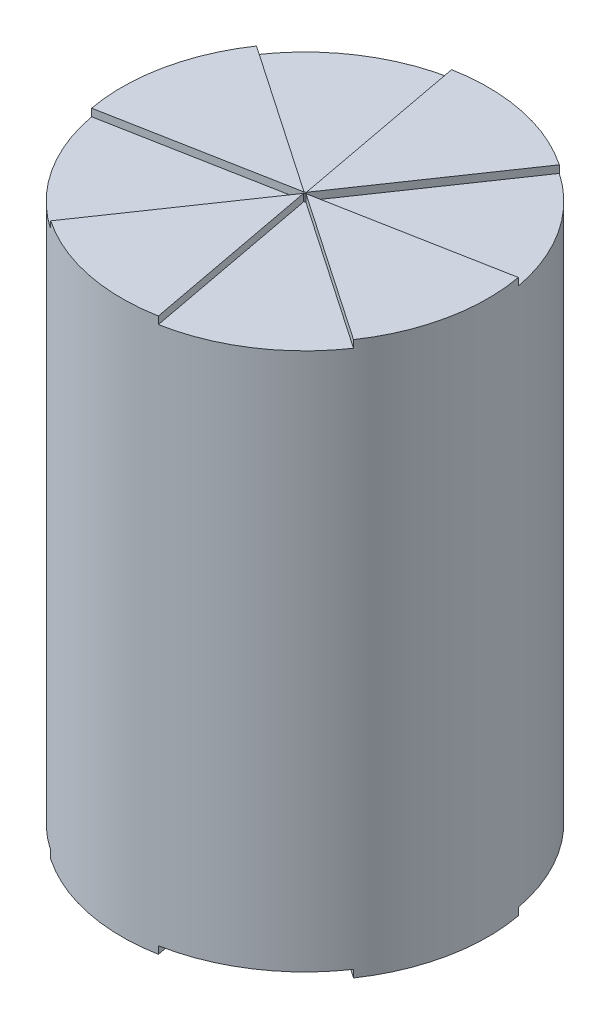
ISO-10303-21;
HEADER;
FILE_DESCRIPTION(('STEP AP214'),'2;1');
FILE_NAME('part.step','',(''),(''),'','','');
FILE_SCHEMA(('AUTOMOTIVE_DESIGN { 1 0 10303 214 1 1 1 1 }'));
ENDSEC;
DATA;
#1=APPLICATION_CONTEXT('core data for automotive mechanical design processes');
#2=APPLICATION_PROTOCOL_DEFINITION('international standard','automotive_design',2000,#1);
#3=PRODUCT_CONTEXT('',#1,'mechanical');
#4=PRODUCT('Part','Part','',(#3));
#5=PRODUCT_RELATED_PRODUCT_CATEGORY('part','',(#4));
#6=PRODUCT_DEFINITION_FORMATION('','',#4);
#7=PRODUCT_DEFINITION_CONTEXT('part definition',#1,'design');
#8=PRODUCT_DEFINITION('design','',#6,#7);
#9=PRODUCT_DEFINITION_SHAPE('','',#8);
#10=(LENGTH_UNIT() NAMED_UNIT(*) SI_UNIT(.MILLI.,.METRE.));
#11=(NAMED_UNIT(*) PLANE_ANGLE_UNIT() SI_UNIT($,.RADIAN.));
#12=(NAMED_UNIT(*) SI_UNIT($,.STERADIAN.) SOLID_ANGLE_UNIT());
#13=UNCERTAINTY_MEASURE_WITH_UNIT(LENGTH_MEASURE(1.E-05),#10,'distance_accuracy_value','');
#14=(GEOMETRIC_REPRESENTATION_CONTEXT(3) GLOBAL_UNCERTAINTY_ASSIGNED_CONTEXT((#13)) GLOBAL_UNIT_ASSIGNED_CONTEXT((#10,
#11,#12)) REPRESENTATION_CONTEXT('',''));
#15=CARTESIAN_POINT('',(0.,0.,0.));
#16=DIRECTION('',(0.,0.,1.));
#17=DIRECTION('',(1.,0.,0.));
#18=AXIS2_PLACEMENT_3D('',#15,#16,#17);
#19=CARTESIAN_POINT('',(0.,187.96,0.));
#20=DIRECTION('',(0.,-1.,0.));
#21=DIRECTION('',(0.,0.,-1.));
#22=AXIS2_PLACEMENT_3D('',#19,#20,#21);
#23=CYLINDRICAL_SURFACE('',#22,62.23);
#24=CARTESIAN_POINT('',(0.,185.42,0.));
#25=DIRECTION('',(0.,1.,0.));
#26=DIRECTION('',(-1.,0.,0.));
#27=AXIS2_PLACEMENT_3D('',#24,#25,#26);
#28=CIRCLE('',#27,62.23);
#29=CARTESIAN_POINT('',(11.3457915218461,185.42,61.1869750416116));
#30=VERTEX_POINT('',#29);
#31=CARTESIAN_POINT('',(51.4696538395341,185.42,34.9778163074617));
#32=VERTEX_POINT('',#31);
#33=EDGE_CURVE('E330',#30,#32,#28,.T.);
#34=ORIENTED_EDGE('',*,*,#33,.F.);
#35=DIRECTION('',(0.,1.,0.));
#36=VECTOR('',#35,1.);
#37=CARTESIAN_POINT('',(11.3457915218461,185.42,61.1869750416116));
#38=LINE('',#37,#36);
#39=CARTESIAN_POINT('',(11.3457915218461,187.96,61.1869750416116));
#40=VERTEX_POINT('',#39);
#41=EDGE_CURVE('E343',#30,#40,#38,.T.);
#42=ORIENTED_EDGE('',*,*,#41,.T.);
#43=CARTESIAN_POINT('',(0.,187.96,0.));
#44=DIRECTION('',(0.,1.,0.));
#45=DIRECTION('',(0.,0.,1.));
#46=AXIS2_PLACEMENT_3D('',#43,#44,#45);
#47=CIRCLE('',#46,62.23);
#48=CARTESIAN_POINT('',(-34.9778163074619,187.96,51.4696538395339));
#49=VERTEX_POINT('',#48);
#50=EDGE_CURVE('E11',#49,#40,#47,.T.);
#51=ORIENTED_EDGE('',*,*,#50,.F.);
#52=DIRECTION('',(0.,1.,0.));
#53=VECTOR('',#52,1.);
#54=CARTESIAN_POINT('',(-34.9778163074619,185.42,51.4696538395339));
#55=LINE('',#54,#53);
#56=CARTESIAN_POINT('',(-34.9778163074619,185.42,51.4696538395339));
#57=VERTEX_POINT('',#56);
#58=EDGE_CURVE('E56',#57,#49,#55,.T.);
#59=ORIENTED_EDGE('',*,*,#58,.F.);
#60=CARTESIAN_POINT('',(0.,185.42,0.));
#61=DIRECTION('',(0.,1.,0.));
#62=DIRECTION('',(0.,0.,-1.));
#63=AXIS2_PLACEMENT_3D('',#60,#61,#62);
#64=CIRCLE('',#63,62.23);
#65=CARTESIAN_POINT('',(-61.1869750416117,185.42,11.3457915218458));
#66=VERTEX_POINT('',#65);
#67=EDGE_CURVE('E354',#66,#57,#64,.T.);
#68=ORIENTED_EDGE('',*,*,#67,.F.);
#69=DIRECTION('',(0.,1.,0.));
#70=VECTOR('',#69,1.);
#71=CARTESIAN_POINT('',(-61.1869750416117,185.42,11.3457915218458));
#72=LINE('',#71,#70);
#73=CARTESIAN_POINT('',(-61.1869750416117,187.96,11.3457915218458));
#74=VERTEX_POINT('',#73);
#75=EDGE_CURVE('E372',#66,#74,#72,.T.);
#76=ORIENTED_EDGE('',*,*,#75,.T.);
#77=CARTESIAN_POINT('',(-51.4696538395343,187.96,-34.9778163074614));
#78=VERTEX_POINT('',#77);
#79=EDGE_CURVE('E41',#78,#74,#47,.T.);
#80=ORIENTED_EDGE('',*,*,#79,.F.);
#81=DIRECTION('',(0.,1.,0.));
#82=VECTOR('',#81,1.);
#83=CARTESIAN_POINT('',(-51.4696538395343,185.42,-34.9778163074614));
#84=LINE('',#83,#82);
#85=CARTESIAN_POINT('',(-51.4696538395343,185.42,-34.9778163074614));
#86=VERTEX_POINT('',#85);
#87=EDGE_CURVE('E300',#86,#78,#84,.T.);
#88=ORIENTED_EDGE('',*,*,#87,.F.);
#89=CARTESIAN_POINT('',(0.,185.42,0.));
#90=DIRECTION('',(0.,1.,0.));
#91=DIRECTION('',(1.,0.,0.));
#92=AXIS2_PLACEMENT_3D('',#89,#90,#91);
#93=CIRCLE('',#92,62.23);
#94=CARTESIAN_POINT('',(-11.3457915218465,185.42,-61.1869750416116));
#95=VERTEX_POINT('',#94);
#96=EDGE_CURVE('E291',#95,#86,#93,.T.);
#97=ORIENTED_EDGE('',*,*,#96,.F.);
#98=DIRECTION('',(0.,1.,0.));
#99=VECTOR('',#98,1.);
#100=CARTESIAN_POINT('',(-11.3457915218465,185.42,-61.1869750416116));
#101=LINE('',#100,#99);
#102=CARTESIAN_POINT('',(-11.3457915218465,187.96,-61.1869750416116));
#103=VERTEX_POINT('',#102);
#104=EDGE_CURVE('E303',#95,#103,#101,.T.);
#105=ORIENTED_EDGE('',*,*,#104,.T.);
#106=CARTESIAN_POINT('',(34.9778163074619,187.96,-51.4696538395339));
#107=VERTEX_POINT('',#106);
#108=EDGE_CURVE('E388',#107,#103,#47,.T.);
#109=ORIENTED_EDGE('',*,*,#108,.F.);
#110=DIRECTION('',(0.,1.,0.));
#111=VECTOR('',#110,1.);
#112=CARTESIAN_POINT('',(34.9778163074619,185.42,-51.4696538395339));
#113=LINE('',#112,#111);
#114=CARTESIAN_POINT('',(34.9778163074619,185.42,-51.4696538395339));
#115=VERTEX_POINT('',#114);
#116=EDGE_CURVE('E319',#115,#107,#113,.T.);
#117=ORIENTED_EDGE('',*,*,#116,.F.);
#118=CARTESIAN_POINT('',(0.,185.42,0.));
#119=DIRECTION('',(0.,1.,0.));
#120=DIRECTION('',(0.,0.,1.));
#121=AXIS2_PLACEMENT_3D('',#118,#119,#120);
#122=CIRCLE('',#121,62.23);
#123=CARTESIAN_POINT('',(61.1869750416117,185.42,-11.3457915218458));
#124=VERTEX_POINT('',#123);
#125=EDGE_CURVE('E310',#124,#115,#122,.T.);
#126=ORIENTED_EDGE('',*,*,#125,.F.);
#127=DIRECTION('',(0.,1.,0.));
#128=VECTOR('',#127,1.);
#129=CARTESIAN_POINT('',(61.1869750416117,185.42,-11.3457915218458));
#130=LINE('',#129,#128);
#131=CARTESIAN_POINT('',(61.1869750416117,187.96,-11.3457915218458));
#132=VERTEX_POINT('',#131);
#133=EDGE_CURVE('E323',#124,#132,#130,.T.);
#134=ORIENTED_EDGE('',*,*,#133,.T.);
#135=CARTESIAN_POINT('',(51.4696538395341,187.96,34.9778163074617));
#136=VERTEX_POINT('',#135);
#137=EDGE_CURVE('E40',#136,#132,#47,.T.);
#138=ORIENTED_EDGE('',*,*,#137,.F.);
#139=DIRECTION('',(0.,1.,0.));
#140=VECTOR('',#139,1.);
#141=CARTESIAN_POINT('',(51.4696538395341,185.42,34.9778163074617));
#142=LINE('',#141,#140);
#143=EDGE_CURVE('E339',#32,#136,#142,.T.);
#144=ORIENTED_EDGE('',*,*,#143,.F.);
#145=EDGE_LOOP('',(#34,#42,#51,#59,#68,#76,#80,#88,#97,#105,#109,#117,#126,#134,#138,#144));
#146=FACE_BOUND('',#145,.T.);
#147=DIRECTION('',(0.,-1.,0.));
#148=VECTOR('',#147,1.);
#149=CARTESIAN_POINT('',(-34.9778163074619,2.54,51.4696538395339));
#150=LINE('',#149,#148);
#151=CARTESIAN_POINT('',(-34.9778163074619,2.54,51.4696538395339));
#152=VERTEX_POINT('',#151);
#153=CARTESIAN_POINT('',(-34.9778163074619,0.,51.4696538395339));
#154=VERTEX_POINT('',#153);
#155=EDGE_CURVE('E287',#152,#154,#150,.T.);
#156=ORIENTED_EDGE('',*,*,#155,.T.);
#157=CARTESIAN_POINT('',(0.,0.,0.));
#158=DIRECTION('',(0.,1.,0.));
#159=DIRECTION('',(0.,0.,1.));
#160=AXIS2_PLACEMENT_3D('',#157,#158,#159);
#161=CIRCLE('',#160,62.23);
#162=CARTESIAN_POINT('',(11.3457915218461,0.,61.1869750416116));
#163=VERTEX_POINT('',#162);
#164=EDGE_CURVE('E35',#154,#163,#161,.T.);
#165=ORIENTED_EDGE('',*,*,#164,.T.);
#166=DIRECTION('',(0.,-1.,0.));
#167=VECTOR('',#166,1.);
#168=CARTESIAN_POINT('',(11.3457915218461,2.54,61.1869750416116));
#169=LINE('',#168,#167);
#170=CARTESIAN_POINT('',(11.3457915218461,2.54,61.1869750416116));
#171=VERTEX_POINT('',#170);
#172=EDGE_CURVE('E251',#171,#163,#169,.T.);
#173=ORIENTED_EDGE('',*,*,#172,.F.);
#174=CARTESIAN_POINT('',(0.,2.54,0.));
#175=DIRECTION('',(0.,1.,0.));
#176=DIRECTION('',(-1.,0.,0.));
#177=AXIS2_PLACEMENT_3D('',#174,#175,#176);
#178=CIRCLE('',#177,62.23);
#179=CARTESIAN_POINT('',(51.4696538395341,2.54,34.9778163074617));
#180=VERTEX_POINT('',#179);
#181=EDGE_CURVE('E242',#171,#180,#178,.T.);
#182=ORIENTED_EDGE('',*,*,#181,.T.);
#183=DIRECTION('',(0.,-1.,0.));
#184=VECTOR('',#183,1.);
#185=CARTESIAN_POINT('',(51.4696538395341,2.54,34.9778163074617));
#186=LINE('',#185,#184);
#187=CARTESIAN_POINT('',(51.4696538395341,0.,34.9778163074617));
#188=VERTEX_POINT('',#187);
#189=EDGE_CURVE('E256',#180,#188,#186,.T.);
#190=ORIENTED_EDGE('',*,*,#189,.T.);
#191=CARTESIAN_POINT('',(61.1869750416117,0.,-11.3457915218458));
#192=VERTEX_POINT('',#191);
#193=EDGE_CURVE('E381',#188,#192,#161,.T.);
#194=ORIENTED_EDGE('',*,*,#193,.T.);
#195=DIRECTION('',(0.,-1.,0.));
#196=VECTOR('',#195,1.);
#197=CARTESIAN_POINT('',(61.1869750416117,2.54,-11.3457915218458));
#198=LINE('',#197,#196);
#199=CARTESIAN_POINT('',(61.1869750416117,2.54,-11.3457915218458));
#200=VERTEX_POINT('',#199);
#201=EDGE_CURVE('E231',#200,#192,#198,.T.);
#202=ORIENTED_EDGE('',*,*,#201,.F.);
#203=CARTESIAN_POINT('',(0.,2.54,0.));
#204=DIRECTION('',(0.,1.,0.));
#205=DIRECTION('',(0.,0.,1.));
#206=AXIS2_PLACEMENT_3D('',#203,#204,#205);
#207=CIRCLE('',#206,62.23);
#208=CARTESIAN_POINT('',(34.9778163074619,2.54,-51.4696538395339));
#209=VERTEX_POINT('',#208);
#210=EDGE_CURVE('E223',#200,#209,#207,.T.);
#211=ORIENTED_EDGE('',*,*,#210,.T.);
#212=DIRECTION('',(0.,-1.,0.));
#213=VECTOR('',#212,1.);
#214=CARTESIAN_POINT('',(34.9778163074619,2.54,-51.4696538395339));
#215=LINE('',#214,#213);
#216=CARTESIAN_POINT('',(34.9778163074619,0.,-51.4696538395339));
#217=VERTEX_POINT('',#216);
#218=EDGE_CURVE('E236',#209,#217,#215,.T.);
#219=ORIENTED_EDGE('',*,*,#218,.T.);
#220=CARTESIAN_POINT('',(-11.3457915218465,0.,-61.1869750416116));
#221=VERTEX_POINT('',#220);
#222=EDGE_CURVE('E215',#217,#221,#161,.T.);
#223=ORIENTED_EDGE('',*,*,#222,.T.);
#224=DIRECTION('',(0.,-1.,0.));
#225=VECTOR('',#224,1.);
#226=CARTESIAN_POINT('',(-11.3457915218465,2.54,-61.1869750416116));
#227=LINE('',#226,#225);
#228=CARTESIAN_POINT('',(-11.3457915218465,2.54,-61.1869750416116));
#229=VERTEX_POINT('',#228);
#230=EDGE_CURVE('E48',#229,#221,#227,.T.);
#231=ORIENTED_EDGE('',*,*,#230,.F.);
#232=CARTESIAN_POINT('',(0.,2.54,0.));
#233=DIRECTION('',(0.,1.,0.));
#234=DIRECTION('',(1.,0.,0.));
#235=AXIS2_PLACEMENT_3D('',#232,#233,#234);
#236=CIRCLE('',#235,62.23);
#237=CARTESIAN_POINT('',(-51.4696538395343,2.54,-34.9778163074614));
#238=VERTEX_POINT('',#237);
#239=EDGE_CURVE('E201',#229,#238,#236,.T.);
#240=ORIENTED_EDGE('',*,*,#239,.T.);
#241=DIRECTION('',(0.,-1.,0.));
#242=VECTOR('',#241,1.);
#243=CARTESIAN_POINT('',(-51.4696538395343,2.54,-34.9778163074614));
#244=LINE('',#243,#242);
#245=CARTESIAN_POINT('',(-51.4696538395343,0.,-34.9778163074614));
#246=VERTEX_POINT('',#245);
#247=EDGE_CURVE('E216',#238,#246,#244,.T.);
#248=ORIENTED_EDGE('',*,*,#247,.T.);
#249=CARTESIAN_POINT('',(-61.1869750416117,0.,11.3457915218458));
#250=VERTEX_POINT('',#249);
#251=EDGE_CURVE('E380',#246,#250,#161,.T.);
#252=ORIENTED_EDGE('',*,*,#251,.T.);
#253=DIRECTION('',(0.,-1.,0.));
#254=VECTOR('',#253,1.);
#255=CARTESIAN_POINT('',(-61.1869750416117,2.54,11.3457915218458));
#256=LINE('',#255,#254);
#257=CARTESIAN_POINT('',(-61.1869750416117,2.54,11.3457915218458));
#258=VERTEX_POINT('',#257);
#259=EDGE_CURVE('E279',#258,#250,#256,.T.);
#260=ORIENTED_EDGE('',*,*,#259,.F.);
#261=CARTESIAN_POINT('',(0.,2.54,0.));
#262=DIRECTION('',(0.,1.,0.));
#263=DIRECTION('',(0.,0.,-1.));
#264=AXIS2_PLACEMENT_3D('',#261,#262,#263);
#265=CIRCLE('',#264,62.23);
#266=EDGE_CURVE('E267',#258,#152,#265,.T.);
#267=ORIENTED_EDGE('',*,*,#266,.T.);
#268=EDGE_LOOP('',(#156,#165,#173,#182,#190,#194,#202,#211,#219,#223,#231,#240,#248,#252,#260,#267));
#269=FACE_BOUND('',#268,.T.);
#270=ADVANCED_FACE('F32',(#146,#269),#23,.T.);
#271=CARTESIAN_POINT('',(0.,0.,0.));
#272=DIRECTION('',(0.,1.,0.));
#273=DIRECTION('',(0.,0.,1.));
#274=AXIS2_PLACEMENT_3D('',#271,#272,#273);
#275=PLANE('',#274);
#276=DIRECTION('',(0.56420608270553,0.,-0.825633996537255));
#277=VECTOR('',#276,1.);
#278=CARTESIAN_POINT('',(-34.9778163074619,0.,51.4696538395339));
#279=LINE('',#278,#277);
#280=CARTESIAN_POINT('',(-0.0861680748122756,0.,0.410773300789611));
#281=VERTEX_POINT('',#280);
#282=EDGE_CURVE('E271',#154,#281,#279,.T.);
#283=ORIENTED_EDGE('',*,*,#282,.T.);
#284=DIRECTION('',(0.184857450661874,0.,0.982765344797421));
#285=VECTOR('',#284,1.);
#286=CARTESIAN_POINT('',(-0.121475110096735,0.,0.223069042287327));
#287=LINE('',#286,#285);
#288=EDGE_CURVE('E241',#281,#163,#287,.T.);
#289=ORIENTED_EDGE('',*,*,#288,.T.);
#290=ORIENTED_EDGE('',*,*,#164,.F.);
#291=EDGE_LOOP('',(#283,#289,#290));
#292=FACE_BOUND('',#291,.T.);
#293=ADVANCED_FACE('F447',(#292),#275,.F.);
#294=DIRECTION('',(-0.982765344797421,0.,0.18485745066187));
#295=VECTOR('',#294,1.);
#296=CARTESIAN_POINT('',(-0.223069042287327,0.,-0.121475110096735));
#297=LINE('',#296,#295);
#298=CARTESIAN_POINT('',(-0.410773300789609,0.,-0.086168074812274));
#299=VERTEX_POINT('',#298);
#300=EDGE_CURVE('E266',#299,#250,#297,.T.);
#301=ORIENTED_EDGE('',*,*,#300,.T.);
#302=ORIENTED_EDGE('',*,*,#251,.F.);
#303=DIRECTION('',(0.825633996537261,0.,0.564206082705522));
#304=VECTOR('',#303,1.);
#305=CARTESIAN_POINT('',(-51.4696538395343,0.,-34.9778163074614));
#306=LINE('',#305,#304);
#307=EDGE_CURVE('E209',#246,#299,#306,.T.);
#308=ORIENTED_EDGE('',*,*,#307,.T.);
#309=EDGE_LOOP('',(#301,#302,#308));
#310=FACE_BOUND('',#309,.T.);
#311=ADVANCED_FACE('F451',(#310),#275,.F.);
#312=DIRECTION('',(-0.825633996537257,0.,-0.564206082705527));
#313=VECTOR('',#312,1.);
#314=CARTESIAN_POINT('',(51.4696538395341,0.,34.9778163074617));
#315=LINE('',#314,#313);
#316=CARTESIAN_POINT('',(0.410773300789592,0.,0.086168074812271));
#317=VERTEX_POINT('',#316);
#318=EDGE_CURVE('E246',#188,#317,#315,.T.);
#319=ORIENTED_EDGE('',*,*,#318,.T.);
#320=DIRECTION('',(0.982765344797421,0.,-0.18485745066187));
#321=VECTOR('',#320,1.);
#322=CARTESIAN_POINT('',(0.223069042287327,0.,0.121475110096735));
#323=LINE('',#322,#321);
#324=EDGE_CURVE('E218',#317,#192,#323,.T.);
#325=ORIENTED_EDGE('',*,*,#324,.T.);
#326=ORIENTED_EDGE('',*,*,#193,.F.);
#327=EDGE_LOOP('',(#319,#325,#326));
#328=FACE_BOUND('',#327,.T.);
#329=ADVANCED_FACE('F457',(#328),#275,.F.);
#330=DIRECTION('',(-0.56420608270553,0.,0.825633996537255));
#331=VECTOR('',#330,1.);
#332=CARTESIAN_POINT('',(34.9778163074619,0.,-51.4696538395339));
#333=LINE('',#332,#331);
#334=CARTESIAN_POINT('',(0.086168074812272,0.,-0.410773300789591));
#335=VERTEX_POINT('',#334);
#336=EDGE_CURVE('E227',#217,#335,#333,.T.);
#337=ORIENTED_EDGE('',*,*,#336,.T.);
#338=DIRECTION('',(-0.184857450661881,0.,-0.982765344797419));
#339=VECTOR('',#338,1.);
#340=CARTESIAN_POINT('',(0.121475110096733,0.,-0.223069042287328));
#341=LINE('',#340,#339);
#342=EDGE_CURVE('E474',#335,#221,#341,.T.);
#343=ORIENTED_EDGE('',*,*,#342,.T.);
#344=ORIENTED_EDGE('',*,*,#222,.F.);
#345=EDGE_LOOP('',(#337,#343,#344));
#346=FACE_BOUND('',#345,.T.);
#347=ADVANCED_FACE('F461',(#346),#275,.F.);
#348=CARTESIAN_POINT('',(0.,187.96,0.));
#349=DIRECTION('',(0.,1.,0.));
#350=DIRECTION('',(0.,0.,1.));
#351=AXIS2_PLACEMENT_3D('',#348,#349,#350);
#352=PLANE('',#351);
#353=DIRECTION('',(0.184857450661874,0.,0.982765344797421));
#354=VECTOR('',#353,1.);
#355=CARTESIAN_POINT('',(-0.121475110096735,187.96,0.223069042287327));
#356=LINE('',#355,#354);
#357=CARTESIAN_POINT('',(-0.0861680748122707,187.96,0.410773300789586));
#358=VERTEX_POINT('',#357);
#359=EDGE_CURVE('E334',#358,#40,#356,.T.);
#360=ORIENTED_EDGE('',*,*,#359,.F.);
#361=DIRECTION('',(0.56420608270553,0.,-0.825633996537255));
#362=VECTOR('',#361,1.);
#363=CARTESIAN_POINT('',(-34.9778163074619,187.96,51.4696538395339));
#364=LINE('',#363,#362);
#365=EDGE_CURVE('E353',#49,#358,#364,.T.);
#366=ORIENTED_EDGE('',*,*,#365,.F.);
#367=ORIENTED_EDGE('',*,*,#50,.T.);
#368=EDGE_LOOP('',(#360,#366,#367));
#369=FACE_BOUND('',#368,.T.);
#370=ADVANCED_FACE('F421',(#369),#352,.T.);
#371=CARTESIAN_POINT('',(0.,187.96,0.));
#372=DIRECTION('',(0.,-1.,0.));
#373=DIRECTION('',(0.,0.,-1.));
#374=AXIS2_PLACEMENT_3D('',#371,#372,#373);
#375=CIRCLE('',#374,0.253999999999998);
#376=CARTESIAN_POINT('',(0.,187.96,-0.253999999999998));
#377=VERTEX_POINT('',#376);
#378=EDGE_CURVE('E367',#377,#377,#375,.T.);
#379=ORIENTED_EDGE('',*,*,#378,.F.);
#380=EDGE_LOOP('',(#379));
#381=FACE_BOUND('',#380,.T.);
#382=ADVANCED_FACE('F444',(#381),#352,.T.);
#383=DIRECTION('',(-0.825633996537257,0.,-0.564206082705527));
#384=VECTOR('',#383,1.);
#385=CARTESIAN_POINT('',(51.4696538395341,187.96,34.9778163074617));
#386=LINE('',#385,#384);
#387=CARTESIAN_POINT('',(0.410773300789593,187.96,0.0861680748122769));
#388=VERTEX_POINT('',#387);
#389=EDGE_CURVE('E329',#136,#388,#386,.T.);
#390=ORIENTED_EDGE('',*,*,#389,.F.);
#391=ORIENTED_EDGE('',*,*,#137,.T.);
#392=DIRECTION('',(0.982765344797421,0.,-0.18485745066187));
#393=VECTOR('',#392,1.);
#394=CARTESIAN_POINT('',(0.223069042287327,187.96,0.121475110096735));
#395=LINE('',#394,#393);
#396=EDGE_CURVE('E314',#388,#132,#395,.T.);
#397=ORIENTED_EDGE('',*,*,#396,.F.);
#398=EDGE_LOOP('',(#390,#391,#397));
#399=FACE_BOUND('',#398,.T.);
#400=ADVANCED_FACE('F402',(#399),#352,.T.);
#401=DIRECTION('',(-0.56420608270553,0.,0.825633996537255));
#402=VECTOR('',#401,1.);
#403=CARTESIAN_POINT('',(34.9778163074619,187.96,-51.4696538395339));
#404=LINE('',#403,#402);
#405=CARTESIAN_POINT('',(0.0861680748122732,187.96,-0.410773300789591));
#406=VERTEX_POINT('',#405);
#407=EDGE_CURVE('E309',#107,#406,#404,.T.);
#408=ORIENTED_EDGE('',*,*,#407,.F.);
#409=ORIENTED_EDGE('',*,*,#108,.T.);
#410=DIRECTION('',(-0.184857450661881,0.,-0.982765344797419));
#411=VECTOR('',#410,1.);
#412=CARTESIAN_POINT('',(0.121475110096733,187.96,-0.223069042287328));
#413=LINE('',#412,#411);
#414=EDGE_CURVE('E295',#406,#103,#413,.T.);
#415=ORIENTED_EDGE('',*,*,#414,.F.);
#416=EDGE_LOOP('',(#408,#409,#415));
#417=FACE_BOUND('',#416,.T.);
#418=ADVANCED_FACE('F437',(#417),#352,.T.);
#419=DIRECTION('',(0.825633996537261,0.,0.564206082705522));
#420=VECTOR('',#419,1.);
#421=CARTESIAN_POINT('',(-51.4696538395343,187.96,-34.9778163074614));
#422=LINE('',#421,#420);
#423=CARTESIAN_POINT('',(-0.410773300789619,187.96,-0.0861680748122789));
#424=VERTEX_POINT('',#423);
#425=EDGE_CURVE('E289',#78,#424,#422,.T.);
#426=ORIENTED_EDGE('',*,*,#425,.F.);
#427=ORIENTED_EDGE('',*,*,#79,.T.);
#428=DIRECTION('',(-0.982765344797421,0.,0.18485745066187));
#429=VECTOR('',#428,1.);
#430=CARTESIAN_POINT('',(-0.223069042287327,187.96,-0.121475110096735));
#431=LINE('',#430,#429);
#432=EDGE_CURVE('E358',#424,#74,#431,.T.);
#433=ORIENTED_EDGE('',*,*,#432,.F.);
#434=EDGE_LOOP('',(#426,#427,#433));
#435=FACE_BOUND('',#434,.T.);
#436=ADVANCED_FACE('F426',(#435),#352,.T.);
#437=CARTESIAN_POINT('',(-0.223069042287327,185.42,-0.121475110096735));
#438=DIRECTION('',(-0.18485745066187,0.,-0.982765344797421));
#439=DIRECTION('',(-0.982765344797421,0.,0.18485745066187));
#440=AXIS2_PLACEMENT_3D('',#437,#438,#439);
#441=PLANE('',#440);
#442=DIRECTION('',(-0.982765344797421,0.,0.18485745066187));
#443=VECTOR('',#442,1.);
#444=CARTESIAN_POINT('',(-0.223069042287327,185.42,-0.121475110096735));
#445=LINE('',#444,#443);
#446=CARTESIAN_POINT('',(-0.410773300789619,185.42,-0.0861680748122789));
#447=VERTEX_POINT('',#446);
#448=EDGE_CURVE('E364',#447,#66,#445,.T.);
#449=ORIENTED_EDGE('',*,*,#448,.F.);
#450=DIRECTION('',(0.,1.,0.));
#451=VECTOR('',#450,1.);
#452=CARTESIAN_POINT('',(-0.41077330078961,185.42,-0.0861680748122737));
#453=LINE('',#452,#451);
#454=EDGE_CURVE('E346',#447,#424,#453,.T.);
#455=ORIENTED_EDGE('',*,*,#454,.T.);
#456=ORIENTED_EDGE('',*,*,#432,.T.);
#457=ORIENTED_EDGE('',*,*,#75,.F.);
#458=EDGE_LOOP('',(#449,#455,#456,#457));
#459=FACE_BOUND('',#458,.T.);
#460=ADVANCED_FACE('F425',(#459),#441,.F.);
#461=CARTESIAN_POINT('',(0.,185.42,0.));
#462=DIRECTION('',(0.,1.,0.));
#463=DIRECTION('',(0.,0.,1.));
#464=AXIS2_PLACEMENT_3D('',#461,#462,#463);
#465=CYLINDRICAL_SURFACE('',#464,0.253999999999998);
#466=ORIENTED_EDGE('',*,*,#378,.T.);
#467=EDGE_LOOP('',(#466));
#468=FACE_BOUND('',#467,.T.);
#469=CARTESIAN_POINT('',(0.,185.42,0.));
#470=DIRECTION('',(0.,-1.,0.));
#471=DIRECTION('',(0.,0.,-1.));
#472=AXIS2_PLACEMENT_3D('',#469,#470,#471);
#473=CIRCLE('',#472,0.253999999999998);
#474=CARTESIAN_POINT('',(0.,185.42,-0.253999999999998));
#475=VERTEX_POINT('',#474);
#476=EDGE_CURVE('E361',#475,#475,#473,.T.);
#477=ORIENTED_EDGE('',*,*,#476,.F.);
#478=EDGE_LOOP('',(#477));
#479=FACE_BOUND('',#478,.T.);
#480=ADVANCED_FACE('F544',(#468,#479),#465,.T.);
#481=CARTESIAN_POINT('',(-34.9778163074619,185.42,51.4696538395339));
#482=DIRECTION('',(0.825633996537255,0.,0.56420608270553));
#483=DIRECTION('',(0.56420608270553,0.,-0.825633996537255));
#484=AXIS2_PLACEMENT_3D('',#481,#482,#483);
#485=PLANE('',#484);
#486=ORIENTED_EDGE('',*,*,#365,.T.);
#487=DIRECTION('',(0.,-1.,0.));
#488=VECTOR('',#487,1.);
#489=CARTESIAN_POINT('',(-0.086168074812272,185.42,0.410773300789605));
#490=LINE('',#489,#488);
#491=CARTESIAN_POINT('',(-0.0861680748122723,185.42,0.41077330078961));
#492=VERTEX_POINT('',#491);
#493=EDGE_CURVE('E350',#358,#492,#490,.T.);
#494=ORIENTED_EDGE('',*,*,#493,.T.);
#495=DIRECTION('',(0.56420608270553,0.,-0.825633996537255));
#496=VECTOR('',#495,1.);
#497=CARTESIAN_POINT('',(-34.9778163074619,185.42,51.4696538395339));
#498=LINE('',#497,#496);
#499=EDGE_CURVE('E357',#57,#492,#498,.T.);
#500=ORIENTED_EDGE('',*,*,#499,.F.);
#501=ORIENTED_EDGE('',*,*,#58,.T.);
#502=EDGE_LOOP('',(#486,#494,#500,#501));
#503=FACE_BOUND('',#502,.T.);
#504=ADVANCED_FACE('F422',(#503),#485,.F.);
#505=CARTESIAN_POINT('',(0.,185.42,0.));
#506=DIRECTION('',(0.,-1.,0.));
#507=DIRECTION('',(0.,0.,-1.));
#508=AXIS2_PLACEMENT_3D('',#505,#506,#507);
#509=PLANE('',#508);
#510=DIRECTION('',(0.825633996537261,0.,0.564206082705522));
#511=VECTOR('',#510,1.);
#512=CARTESIAN_POINT('',(-51.4696538395343,185.42,-34.9778163074614));
#513=LINE('',#512,#511);
#514=EDGE_CURVE('E294',#86,#447,#513,.T.);
#515=ORIENTED_EDGE('',*,*,#514,.T.);
#516=ORIENTED_EDGE('',*,*,#448,.T.);
#517=ORIENTED_EDGE('',*,*,#67,.T.);
#518=ORIENTED_EDGE('',*,*,#499,.T.);
#519=DIRECTION('',(0.184857450661874,0.,0.982765344797421));
#520=VECTOR('',#519,1.);
#521=CARTESIAN_POINT('',(-0.121475110096735,185.42,0.223069042287327));
#522=LINE('',#521,#520);
#523=EDGE_CURVE('E337',#492,#30,#522,.T.);
#524=ORIENTED_EDGE('',*,*,#523,.T.);
#525=ORIENTED_EDGE('',*,*,#33,.T.);
#526=DIRECTION('',(-0.825633996537257,0.,-0.564206082705527));
#527=VECTOR('',#526,1.);
#528=CARTESIAN_POINT('',(51.4696538395341,185.42,34.9778163074617));
#529=LINE('',#528,#527);
#530=CARTESIAN_POINT('',(0.410773300789593,185.42,0.0861680748122769));
#531=VERTEX_POINT('',#530);
#532=EDGE_CURVE('E333',#32,#531,#529,.T.);
#533=ORIENTED_EDGE('',*,*,#532,.T.);
#534=DIRECTION('',(0.982765344797421,0.,-0.18485745066187));
#535=VECTOR('',#534,1.);
#536=CARTESIAN_POINT('',(0.223069042287327,185.42,0.121475110096735));
#537=LINE('',#536,#535);
#538=EDGE_CURVE('E317',#531,#124,#537,.T.);
#539=ORIENTED_EDGE('',*,*,#538,.T.);
#540=ORIENTED_EDGE('',*,*,#125,.T.);
#541=DIRECTION('',(-0.56420608270553,0.,0.825633996537255));
#542=VECTOR('',#541,1.);
#543=CARTESIAN_POINT('',(34.9778163074619,185.42,-51.4696538395339));
#544=LINE('',#543,#542);
#545=CARTESIAN_POINT('',(0.0861680748122732,185.42,-0.410773300789591));
#546=VERTEX_POINT('',#545);
#547=EDGE_CURVE('E313',#115,#546,#544,.T.);
#548=ORIENTED_EDGE('',*,*,#547,.T.);
#549=DIRECTION('',(-0.184857450661881,0.,-0.982765344797419));
#550=VECTOR('',#549,1.);
#551=CARTESIAN_POINT('',(0.121475110096733,185.42,-0.223069042287328));
#552=LINE('',#551,#550);
#553=EDGE_CURVE('E298',#546,#95,#552,.T.);
#554=ORIENTED_EDGE('',*,*,#553,.T.);
#555=ORIENTED_EDGE('',*,*,#96,.T.);
#556=EDGE_LOOP('',(#515,#516,#517,#518,#524,#525,#533,#539,#540,#548,#554,#555));
#557=FACE_BOUND('',#556,.T.);
#558=ORIENTED_EDGE('',*,*,#476,.T.);
#559=EDGE_LOOP('',(#558));
#560=FACE_BOUND('',#559,.T.);
#561=ADVANCED_FACE('F414',(#557,#560),#509,.F.);
#562=CARTESIAN_POINT('',(-0.121475110096735,185.42,0.223069042287327));
#563=DIRECTION('',(-0.98276534479742,0.,0.184857450661874));
#564=DIRECTION('',(0.184857450661874,0.,0.982765344797421));
#565=AXIS2_PLACEMENT_3D('',#562,#563,#564);
#566=PLANE('',#565);
#567=ORIENTED_EDGE('',*,*,#359,.T.);
#568=ORIENTED_EDGE('',*,*,#41,.F.);
#569=ORIENTED_EDGE('',*,*,#523,.F.);
#570=ORIENTED_EDGE('',*,*,#493,.F.);
#571=EDGE_LOOP('',(#567,#568,#569,#570));
#572=FACE_BOUND('',#571,.T.);
#573=ADVANCED_FACE('F531',(#572),#566,.F.);
#574=CARTESIAN_POINT('',(-51.4696538395343,185.42,-34.9778163074614));
#575=DIRECTION('',(-0.564206082705522,0.,0.825633996537261));
#576=DIRECTION('',(0.825633996537261,0.,0.564206082705522));
#577=AXIS2_PLACEMENT_3D('',#574,#575,#576);
#578=PLANE('',#577);
#579=ORIENTED_EDGE('',*,*,#514,.F.);
#580=ORIENTED_EDGE('',*,*,#87,.T.);
#581=ORIENTED_EDGE('',*,*,#425,.T.);
#582=ORIENTED_EDGE('',*,*,#454,.F.);
#583=EDGE_LOOP('',(#579,#580,#581,#582));
#584=FACE_BOUND('',#583,.T.);
#585=ADVANCED_FACE('F430',(#584),#578,.F.);
#586=CARTESIAN_POINT('',(51.4696538395341,185.42,34.9778163074617));
#587=DIRECTION('',(0.564206082705527,0.,-0.825633996537257));
#588=DIRECTION('',(-0.825633996537257,0.,-0.564206082705528));
#589=AXIS2_PLACEMENT_3D('',#586,#587,#588);
#590=PLANE('',#589);
#591=DIRECTION('',(0.,-1.,0.));
#592=VECTOR('',#591,1.);
#593=CARTESIAN_POINT('',(0.410773300789598,185.42,0.086168074812272));
#594=LINE('',#593,#592);
#595=EDGE_CURVE('E326',#388,#531,#594,.T.);
#596=ORIENTED_EDGE('',*,*,#595,.T.);
#597=ORIENTED_EDGE('',*,*,#532,.F.);
#598=ORIENTED_EDGE('',*,*,#143,.T.);
#599=ORIENTED_EDGE('',*,*,#389,.T.);
#600=EDGE_LOOP('',(#596,#597,#598,#599));
#601=FACE_BOUND('',#600,.T.);
#602=ADVANCED_FACE('F412',(#601),#590,.F.);
#603=CARTESIAN_POINT('',(0.223069042287327,185.42,0.121475110096735));
#604=DIRECTION('',(0.18485745066187,0.,0.982765344797421));
#605=DIRECTION('',(0.982765344797421,0.,-0.18485745066187));
#606=AXIS2_PLACEMENT_3D('',#603,#604,#605);
#607=PLANE('',#606);
#608=ORIENTED_EDGE('',*,*,#396,.T.);
#609=ORIENTED_EDGE('',*,*,#133,.F.);
#610=ORIENTED_EDGE('',*,*,#538,.F.);
#611=ORIENTED_EDGE('',*,*,#595,.F.);
#612=EDGE_LOOP('',(#608,#609,#610,#611));
#613=FACE_BOUND('',#612,.T.);
#614=ADVANCED_FACE('F410',(#613),#607,.F.);
#615=CARTESIAN_POINT('',(34.9778163074619,185.42,-51.4696538395339));
#616=DIRECTION('',(-0.825633996537255,0.,-0.56420608270553));
#617=DIRECTION('',(-0.56420608270553,0.,0.825633996537255));
#618=AXIS2_PLACEMENT_3D('',#615,#616,#617);
#619=PLANE('',#618);
#620=DIRECTION('',(0.,-1.,0.));
#621=VECTOR('',#620,1.);
#622=CARTESIAN_POINT('',(0.086168074812272,185.42,-0.410773300789598));
#623=LINE('',#622,#621);
#624=EDGE_CURVE('E306',#406,#546,#623,.T.);
#625=ORIENTED_EDGE('',*,*,#624,.T.);
#626=ORIENTED_EDGE('',*,*,#547,.F.);
#627=ORIENTED_EDGE('',*,*,#116,.T.);
#628=ORIENTED_EDGE('',*,*,#407,.T.);
#629=EDGE_LOOP('',(#625,#626,#627,#628));
#630=FACE_BOUND('',#629,.T.);
#631=ADVANCED_FACE('F436',(#630),#619,.F.);
#632=CARTESIAN_POINT('',(0.121475110096733,185.42,-0.223069042287328));
#633=DIRECTION('',(0.982765344797419,0.,-0.184857450661881));
#634=DIRECTION('',(-0.184857450661881,0.,-0.982765344797419));
#635=AXIS2_PLACEMENT_3D('',#632,#633,#634);
#636=PLANE('',#635);
#637=ORIENTED_EDGE('',*,*,#414,.T.);
#638=ORIENTED_EDGE('',*,*,#104,.F.);
#639=ORIENTED_EDGE('',*,*,#553,.F.);
#640=ORIENTED_EDGE('',*,*,#624,.F.);
#641=EDGE_LOOP('',(#637,#638,#639,#640));
#642=FACE_BOUND('',#641,.T.);
#643=ADVANCED_FACE('F434',(#642),#636,.F.);
#644=CARTESIAN_POINT('',(-34.9778163074619,2.54,51.4696538395339));
#645=DIRECTION('',(-0.825633996537255,0.,-0.56420608270553));
#646=DIRECTION('',(-0.56420608270553,0.,0.825633996537255));
#647=AXIS2_PLACEMENT_3D('',#644,#645,#646);
#648=PLANE('',#647);
#649=DIRECTION('',(0.,-1.,0.));
#650=VECTOR('',#649,1.);
#651=CARTESIAN_POINT('',(-0.086168074812272,2.54,0.410773300789605));
#652=LINE('',#651,#650);
#653=CARTESIAN_POINT('',(-0.0861680748122756,2.54,0.410773300789611));
#654=VERTEX_POINT('',#653);
#655=EDGE_CURVE('E264',#654,#281,#652,.T.);
#656=ORIENTED_EDGE('',*,*,#655,.T.);
#657=ORIENTED_EDGE('',*,*,#282,.F.);
#658=ORIENTED_EDGE('',*,*,#155,.F.);
#659=DIRECTION('',(0.56420608270553,0.,-0.825633996537255));
#660=VECTOR('',#659,1.);
#661=CARTESIAN_POINT('',(-34.9778163074619,2.54,51.4696538395339));
#662=LINE('',#661,#660);
#663=EDGE_CURVE('E276',#152,#654,#662,.T.);
#664=ORIENTED_EDGE('',*,*,#663,.T.);
#665=EDGE_LOOP('',(#656,#657,#658,#664));
#666=FACE_BOUND('',#665,.T.);
#667=ADVANCED_FACE('F493',(#666),#648,.T.);
#668=CARTESIAN_POINT('',(-0.223069042287327,2.54,-0.121475110096735));
#669=DIRECTION('',(0.18485745066187,0.,0.982765344797421));
#670=DIRECTION('',(0.982765344797421,0.,-0.18485745066187));
#671=AXIS2_PLACEMENT_3D('',#668,#669,#670);
#672=PLANE('',#671);
#673=DIRECTION('',(0.,1.,0.));
#674=VECTOR('',#673,1.);
#675=CARTESIAN_POINT('',(-0.41077330078961,2.54,-0.0861680748122737));
#676=LINE('',#675,#674);
#677=CARTESIAN_POINT('',(-0.410773300789619,2.54,-0.0861680748122789));
#678=VERTEX_POINT('',#677);
#679=EDGE_CURVE('E261',#299,#678,#676,.T.);
#680=ORIENTED_EDGE('',*,*,#679,.T.);
#681=DIRECTION('',(-0.982765344797421,0.,0.18485745066187));
#682=VECTOR('',#681,1.);
#683=CARTESIAN_POINT('',(-0.223069042287327,2.54,-0.121475110096735));
#684=LINE('',#683,#682);
#685=EDGE_CURVE('E270',#678,#258,#684,.T.);
#686=ORIENTED_EDGE('',*,*,#685,.T.);
#687=ORIENTED_EDGE('',*,*,#259,.T.);
#688=ORIENTED_EDGE('',*,*,#300,.F.);
#689=EDGE_LOOP('',(#680,#686,#687,#688));
#690=FACE_BOUND('',#689,.T.);
#691=ADVANCED_FACE('F497',(#690),#672,.T.);
#692=CARTESIAN_POINT('',(0.,2.54,0.));
#693=DIRECTION('',(0.,-1.,0.));
#694=DIRECTION('',(0.,0.,-1.));
#695=AXIS2_PLACEMENT_3D('',#692,#693,#694);
#696=CYLINDRICAL_SURFACE('',#695,0.253999999999998);
#697=CARTESIAN_POINT('',(0.,0.,0.));
#698=DIRECTION('',(0.,-1.,0.));
#699=DIRECTION('',(0.,0.,-1.));
#700=AXIS2_PLACEMENT_3D('',#697,#698,#699);
#701=CIRCLE('',#700,0.253999999999998);
#702=CARTESIAN_POINT('',(0.,0.,-0.253999999999998));
#703=VERTEX_POINT('',#702);
#704=EDGE_CURVE('E282',#703,#703,#701,.T.);
#705=ORIENTED_EDGE('',*,*,#704,.F.);
#706=EDGE_LOOP('',(#705));
#707=FACE_BOUND('',#706,.T.);
#708=CARTESIAN_POINT('',(0.,2.54,0.));
#709=DIRECTION('',(0.,-1.,0.));
#710=DIRECTION('',(0.,0.,-1.));
#711=AXIS2_PLACEMENT_3D('',#708,#709,#710);
#712=CIRCLE('',#711,0.253999999999998);
#713=CARTESIAN_POINT('',(0.,2.54,-0.253999999999998));
#714=VERTEX_POINT('',#713);
#715=EDGE_CURVE('E273',#714,#714,#712,.T.);
#716=ORIENTED_EDGE('',*,*,#715,.T.);
#717=EDGE_LOOP('',(#716));
#718=FACE_BOUND('',#717,.T.);
#719=ADVANCED_FACE('F518',(#707,#718),#696,.T.);
#720=CARTESIAN_POINT('',(0.,2.54,0.));
#721=DIRECTION('',(0.,1.,0.));
#722=DIRECTION('',(0.,0.,-1.));
#723=AXIS2_PLACEMENT_3D('',#720,#721,#722);
#724=PLANE('',#723);
#725=ORIENTED_EDGE('',*,*,#715,.F.);
#726=EDGE_LOOP('',(#725));
#727=FACE_BOUND('',#726,.T.);
#728=ORIENTED_EDGE('',*,*,#663,.F.);
#729=ORIENTED_EDGE('',*,*,#266,.F.);
#730=ORIENTED_EDGE('',*,*,#685,.F.);
#731=DIRECTION('',(0.825633996537261,0.,0.564206082705522));
#732=VECTOR('',#731,1.);
#733=CARTESIAN_POINT('',(-51.4696538395343,2.54,-34.9778163074614));
#734=LINE('',#733,#732);
#735=EDGE_CURVE('E200',#238,#678,#734,.T.);
#736=ORIENTED_EDGE('',*,*,#735,.F.);
#737=ORIENTED_EDGE('',*,*,#239,.F.);
#738=DIRECTION('',(-0.184857450661881,0.,-0.982765344797419));
#739=VECTOR('',#738,1.);
#740=CARTESIAN_POINT('',(0.121475110096733,2.54,-0.223069042287328));
#741=LINE('',#740,#739);
#742=CARTESIAN_POINT('',(0.086168074812272,2.54,-0.410773300789591));
#743=VERTEX_POINT('',#742);
#744=EDGE_CURVE('E194',#743,#229,#741,.T.);
#745=ORIENTED_EDGE('',*,*,#744,.F.);
#746=DIRECTION('',(-0.56420608270553,0.,0.825633996537255));
#747=VECTOR('',#746,1.);
#748=CARTESIAN_POINT('',(34.9778163074619,2.54,-51.4696538395339));
#749=LINE('',#748,#747);
#750=EDGE_CURVE('E229',#209,#743,#749,.T.);
#751=ORIENTED_EDGE('',*,*,#750,.F.);
#752=ORIENTED_EDGE('',*,*,#210,.F.);
#753=DIRECTION('',(0.982765344797421,0.,-0.18485745066187));
#754=VECTOR('',#753,1.);
#755=CARTESIAN_POINT('',(0.223069042287327,2.54,0.121475110096735));
#756=LINE('',#755,#754);
#757=CARTESIAN_POINT('',(0.410773300789592,2.54,0.086168074812271));
#758=VERTEX_POINT('',#757);
#759=EDGE_CURVE('E226',#758,#200,#756,.T.);
#760=ORIENTED_EDGE('',*,*,#759,.F.);
#761=DIRECTION('',(-0.825633996537257,0.,-0.564206082705527));
#762=VECTOR('',#761,1.);
#763=CARTESIAN_POINT('',(51.4696538395341,2.54,34.9778163074617));
#764=LINE('',#763,#762);
#765=EDGE_CURVE('E248',#180,#758,#764,.T.);
#766=ORIENTED_EDGE('',*,*,#765,.F.);
#767=ORIENTED_EDGE('',*,*,#181,.F.);
#768=DIRECTION('',(0.184857450661874,0.,0.982765344797421));
#769=VECTOR('',#768,1.);
#770=CARTESIAN_POINT('',(-0.121475110096735,2.54,0.223069042287327));
#771=LINE('',#770,#769);
#772=EDGE_CURVE('E245',#654,#171,#771,.T.);
#773=ORIENTED_EDGE('',*,*,#772,.F.);
#774=EDGE_LOOP('',(#728,#729,#730,#736,#737,#745,#751,#752,#760,#766,#767,#773));
#775=FACE_BOUND('',#774,.T.);
#776=ADVANCED_FACE('F204',(#727,#775),#724,.F.);
#777=CARTESIAN_POINT('',(-0.121475110096735,2.54,0.223069042287327));
#778=DIRECTION('',(0.98276534479742,0.,-0.184857450661874));
#779=DIRECTION('',(-0.184857450661874,0.,-0.982765344797421));
#780=AXIS2_PLACEMENT_3D('',#777,#778,#779);
#781=PLANE('',#780);
#782=ORIENTED_EDGE('',*,*,#772,.T.);
#783=ORIENTED_EDGE('',*,*,#172,.T.);
#784=ORIENTED_EDGE('',*,*,#288,.F.);
#785=ORIENTED_EDGE('',*,*,#655,.F.);
#786=EDGE_LOOP('',(#782,#783,#784,#785));
#787=FACE_BOUND('',#786,.T.);
#788=ADVANCED_FACE('F490',(#787),#781,.T.);
#789=CARTESIAN_POINT('',(-51.4696538395343,2.54,-34.9778163074614));
#790=DIRECTION('',(0.564206082705522,0.,-0.825633996537261));
#791=DIRECTION('',(-0.825633996537261,0.,-0.564206082705522));
#792=AXIS2_PLACEMENT_3D('',#789,#790,#791);
#793=PLANE('',#792);
#794=ORIENTED_EDGE('',*,*,#307,.F.);
#795=ORIENTED_EDGE('',*,*,#247,.F.);
#796=ORIENTED_EDGE('',*,*,#735,.T.);
#797=ORIENTED_EDGE('',*,*,#679,.F.);
#798=EDGE_LOOP('',(#794,#795,#796,#797));
#799=FACE_BOUND('',#798,.T.);
#800=ADVANCED_FACE('F500',(#799),#793,.T.);
#801=CARTESIAN_POINT('',(34.9778163074619,2.54,-51.4696538395339));
#802=DIRECTION('',(0.825633996537255,0.,0.56420608270553));
#803=DIRECTION('',(0.56420608270553,0.,-0.825633996537255));
#804=AXIS2_PLACEMENT_3D('',#801,#802,#803);
#805=PLANE('',#804);
#806=DIRECTION('',(0.,-1.,0.));
#807=VECTOR('',#806,1.);
#808=CARTESIAN_POINT('',(0.086168074812272,2.54,-0.410773300789598));
#809=LINE('',#808,#807);
#810=EDGE_CURVE('E197',#743,#335,#809,.T.);
#811=ORIENTED_EDGE('',*,*,#810,.T.);
#812=ORIENTED_EDGE('',*,*,#336,.F.);
#813=ORIENTED_EDGE('',*,*,#218,.F.);
#814=ORIENTED_EDGE('',*,*,#750,.T.);
#815=EDGE_LOOP('',(#811,#812,#813,#814));
#816=FACE_BOUND('',#815,.T.);
#817=ADVANCED_FACE('F477',(#816),#805,.T.);
#818=CARTESIAN_POINT('',(51.4696538395341,2.54,34.9778163074617));
#819=DIRECTION('',(-0.564206082705527,0.,0.825633996537257));
#820=DIRECTION('',(0.825633996537257,0.,0.564206082705528));
#821=AXIS2_PLACEMENT_3D('',#818,#819,#820);
#822=PLANE('',#821);
#823=DIRECTION('',(0.,-1.,0.));
#824=VECTOR('',#823,1.);
#825=CARTESIAN_POINT('',(0.410773300789598,2.54,0.086168074812272));
#826=LINE('',#825,#824);
#827=EDGE_CURVE('E238',#758,#317,#826,.T.);
#828=ORIENTED_EDGE('',*,*,#827,.T.);
#829=ORIENTED_EDGE('',*,*,#318,.F.);
#830=ORIENTED_EDGE('',*,*,#189,.F.);
#831=ORIENTED_EDGE('',*,*,#765,.T.);
#832=EDGE_LOOP('',(#828,#829,#830,#831));
#833=FACE_BOUND('',#832,.T.);
#834=ADVANCED_FACE('F485',(#833),#822,.T.);
#835=CARTESIAN_POINT('',(0.223069042287327,2.54,0.121475110096735));
#836=DIRECTION('',(-0.18485745066187,0.,-0.982765344797421));
#837=DIRECTION('',(-0.982765344797421,0.,0.18485745066187));
#838=AXIS2_PLACEMENT_3D('',#835,#836,#837);
#839=PLANE('',#838);
#840=ORIENTED_EDGE('',*,*,#759,.T.);
#841=ORIENTED_EDGE('',*,*,#201,.T.);
#842=ORIENTED_EDGE('',*,*,#324,.F.);
#843=ORIENTED_EDGE('',*,*,#827,.F.);
#844=EDGE_LOOP('',(#840,#841,#842,#843));
#845=FACE_BOUND('',#844,.T.);
#846=ADVANCED_FACE('F465',(#845),#839,.T.);
#847=CARTESIAN_POINT('',(0.121475110096733,2.54,-0.223069042287328));
#848=DIRECTION('',(-0.982765344797419,0.,0.184857450661881));
#849=DIRECTION('',(0.184857450661881,0.,0.982765344797419));
#850=AXIS2_PLACEMENT_3D('',#847,#848,#849);
#851=PLANE('',#850);
#852=ORIENTED_EDGE('',*,*,#744,.T.);
#853=ORIENTED_EDGE('',*,*,#230,.T.);
#854=ORIENTED_EDGE('',*,*,#342,.F.);
#855=ORIENTED_EDGE('',*,*,#810,.F.);
#856=EDGE_LOOP('',(#852,#853,#854,#855));
#857=FACE_BOUND('',#856,.T.);
#858=ADVANCED_FACE('F196',(#857),#851,.T.);
#859=ORIENTED_EDGE('',*,*,#704,.T.);
#860=EDGE_LOOP('',(#859));
#861=FACE_BOUND('',#860,.T.);
#862=ADVANCED_FACE('F453',(#861),#275,.F.);
#863=CLOSED_SHELL('',(#270,#293,#311,#329,#347,#370,#382,#400,#418,#436,#460,#480,#504,#561,
#573,#585,#602,#614,#631,#643,#667,#691,#719,#776,#788,#800,#817,#834,#846,#858,#862));
#864=MANIFOLD_SOLID_BREP('B2',#863);
#865=ADVANCED_BREP_SHAPE_REPRESENTATION('',(#18,#864),#14);
#866=SHAPE_DEFINITION_REPRESENTATION(#9,#865);
ENDSEC;
END-ISO-10303-21;
